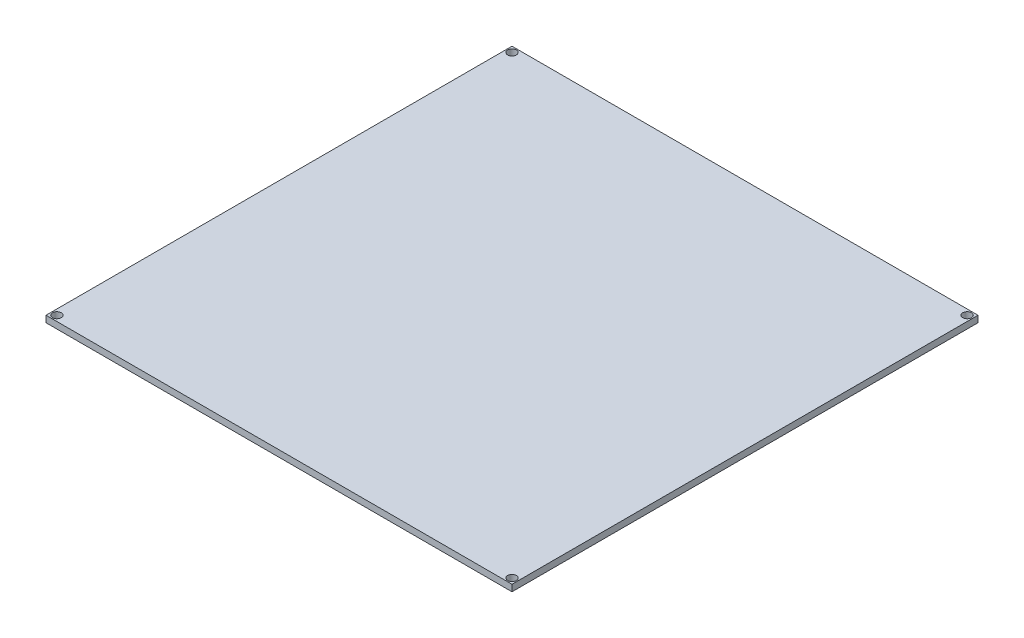
ISO-10303-21;
HEADER;
FILE_DESCRIPTION(('STEP AP214'),'2;1');
FILE_NAME('part.step','',(''),(''),'','','');
FILE_SCHEMA(('AUTOMOTIVE_DESIGN { 1 0 10303 214 1 1 1 1 }'));
ENDSEC;
DATA;
#1=APPLICATION_CONTEXT('core data for automotive mechanical design processes');
#2=APPLICATION_PROTOCOL_DEFINITION('international standard','automotive_design',2000,#1);
#3=PRODUCT_CONTEXT('',#1,'mechanical');
#4=PRODUCT('Part','Part','',(#3));
#5=PRODUCT_RELATED_PRODUCT_CATEGORY('part','',(#4));
#6=PRODUCT_DEFINITION_FORMATION('','',#4);
#7=PRODUCT_DEFINITION_CONTEXT('part definition',#1,'design');
#8=PRODUCT_DEFINITION('design','',#6,#7);
#9=PRODUCT_DEFINITION_SHAPE('','',#8);
#10=(LENGTH_UNIT() NAMED_UNIT(*) SI_UNIT(.MILLI.,.METRE.));
#11=(NAMED_UNIT(*) PLANE_ANGLE_UNIT() SI_UNIT($,.RADIAN.));
#12=(NAMED_UNIT(*) SI_UNIT($,.STERADIAN.) SOLID_ANGLE_UNIT());
#13=UNCERTAINTY_MEASURE_WITH_UNIT(LENGTH_MEASURE(1.E-05),#10,'distance_accuracy_value','');
#14=(GEOMETRIC_REPRESENTATION_CONTEXT(3) GLOBAL_UNCERTAINTY_ASSIGNED_CONTEXT((#13)) GLOBAL_UNIT_ASSIGNED_CONTEXT((#10,
#11,#12)) REPRESENTATION_CONTEXT('',''));
#15=CARTESIAN_POINT('',(0.,0.,0.));
#16=DIRECTION('',(0.,0.,1.));
#17=DIRECTION('',(1.,0.,0.));
#18=AXIS2_PLACEMENT_3D('',#15,#16,#17);
#19=CARTESIAN_POINT('',(0.,3.,0.));
#20=DIRECTION('',(0.,-1.,0.));
#21=DIRECTION('',(0.,0.,-1.));
#22=AXIS2_PLACEMENT_3D('',#19,#20,#21);
#23=PLANE('',#22);
#24=DIRECTION('',(0.,0.,-1.));
#25=VECTOR('',#24,1.);
#26=CARTESIAN_POINT('',(107.,3.,107.));
#27=LINE('',#26,#25);
#28=CARTESIAN_POINT('',(107.,3.,107.));
#29=VERTEX_POINT('',#28);
#30=CARTESIAN_POINT('',(107.,3.,-107.));
#31=VERTEX_POINT('',#30);
#32=EDGE_CURVE('E89',#29,#31,#27,.T.);
#33=ORIENTED_EDGE('',*,*,#32,.T.);
#34=DIRECTION('',(-1.,0.,0.));
#35=VECTOR('',#34,1.);
#36=CARTESIAN_POINT('',(-107.,3.,-107.));
#37=LINE('',#36,#35);
#38=CARTESIAN_POINT('',(-107.,3.,-107.));
#39=VERTEX_POINT('',#38);
#40=EDGE_CURVE('E84',#31,#39,#37,.T.);
#41=ORIENTED_EDGE('',*,*,#40,.T.);
#42=DIRECTION('',(0.,0.,1.));
#43=VECTOR('',#42,1.);
#44=CARTESIAN_POINT('',(-107.,3.,107.));
#45=LINE('',#44,#43);
#46=CARTESIAN_POINT('',(-107.,3.,107.));
#47=VERTEX_POINT('',#46);
#48=EDGE_CURVE('E87',#39,#47,#45,.T.);
#49=ORIENTED_EDGE('',*,*,#48,.T.);
#50=DIRECTION('',(1.,0.,0.));
#51=VECTOR('',#50,1.);
#52=CARTESIAN_POINT('',(-107.,3.,107.));
#53=LINE('',#52,#51);
#54=EDGE_CURVE('E54',#47,#29,#53,.T.);
#55=ORIENTED_EDGE('',*,*,#54,.T.);
#56=EDGE_LOOP('',(#33,#41,#49,#55));
#57=FACE_BOUND('',#56,.T.);
#58=CARTESIAN_POINT('',(-104.5,3.,-104.5));
#59=DIRECTION('',(0.,1.,0.));
#60=DIRECTION('',(0.,0.,1.));
#61=AXIS2_PLACEMENT_3D('',#58,#59,#60);
#62=CIRCLE('',#61,2.);
#63=CARTESIAN_POINT('',(-104.5,3.,-102.5));
#64=VERTEX_POINT('',#63);
#65=EDGE_CURVE('E104',#64,#64,#62,.T.);
#66=ORIENTED_EDGE('',*,*,#65,.F.);
#67=EDGE_LOOP('',(#66));
#68=FACE_BOUND('',#67,.T.);
#69=CARTESIAN_POINT('',(104.5,3.,-104.5));
#70=DIRECTION('',(0.,1.,0.));
#71=DIRECTION('',(0.,0.,1.));
#72=AXIS2_PLACEMENT_3D('',#69,#70,#71);
#73=CIRCLE('',#72,2.);
#74=CARTESIAN_POINT('',(104.5,3.,-102.5));
#75=VERTEX_POINT('',#74);
#76=EDGE_CURVE('E119',#75,#75,#73,.T.);
#77=ORIENTED_EDGE('',*,*,#76,.F.);
#78=EDGE_LOOP('',(#77));
#79=FACE_BOUND('',#78,.T.);
#80=CARTESIAN_POINT('',(104.5,3.,104.5));
#81=DIRECTION('',(0.,1.,0.));
#82=DIRECTION('',(0.,0.,1.));
#83=AXIS2_PLACEMENT_3D('',#80,#81,#82);
#84=CIRCLE('',#83,2.);
#85=CARTESIAN_POINT('',(104.5,3.,106.5));
#86=VERTEX_POINT('',#85);
#87=EDGE_CURVE('E125',#86,#86,#84,.T.);
#88=ORIENTED_EDGE('',*,*,#87,.F.);
#89=EDGE_LOOP('',(#88));
#90=FACE_BOUND('',#89,.T.);
#91=CARTESIAN_POINT('',(-104.5,3.,104.5));
#92=DIRECTION('',(0.,1.,0.));
#93=DIRECTION('',(0.,0.,1.));
#94=AXIS2_PLACEMENT_3D('',#91,#92,#93);
#95=CIRCLE('',#94,2.);
#96=CARTESIAN_POINT('',(-104.5,3.,106.5));
#97=VERTEX_POINT('',#96);
#98=EDGE_CURVE('E131',#97,#97,#95,.T.);
#99=ORIENTED_EDGE('',*,*,#98,.F.);
#100=EDGE_LOOP('',(#99));
#101=FACE_BOUND('',#100,.T.);
#102=ADVANCED_FACE('F37',(#57,#68,#79,#90,#101),#23,.F.);
#103=CARTESIAN_POINT('',(0.,0.,0.));
#104=DIRECTION('',(0.,-1.,0.));
#105=DIRECTION('',(0.,0.,-1.));
#106=AXIS2_PLACEMENT_3D('',#103,#104,#105);
#107=PLANE('',#106);
#108=CARTESIAN_POINT('',(104.5,0.,104.5));
#109=DIRECTION('',(0.,1.,0.));
#110=DIRECTION('',(0.,0.,1.));
#111=AXIS2_PLACEMENT_3D('',#108,#109,#110);
#112=CIRCLE('',#111,2.);
#113=CARTESIAN_POINT('',(104.5,0.,106.5));
#114=VERTEX_POINT('',#113);
#115=EDGE_CURVE('E128',#114,#114,#112,.T.);
#116=ORIENTED_EDGE('',*,*,#115,.T.);
#117=EDGE_LOOP('',(#116));
#118=FACE_BOUND('',#117,.T.);
#119=CARTESIAN_POINT('',(-104.5,0.,-104.5));
#120=DIRECTION('',(0.,1.,0.));
#121=DIRECTION('',(0.,0.,1.));
#122=AXIS2_PLACEMENT_3D('',#119,#120,#121);
#123=CIRCLE('',#122,2.);
#124=CARTESIAN_POINT('',(-104.5,0.,-102.5));
#125=VERTEX_POINT('',#124);
#126=EDGE_CURVE('E116',#125,#125,#123,.T.);
#127=ORIENTED_EDGE('',*,*,#126,.T.);
#128=EDGE_LOOP('',(#127));
#129=FACE_BOUND('',#128,.T.);
#130=DIRECTION('',(0.,0.,-1.));
#131=VECTOR('',#130,1.);
#132=CARTESIAN_POINT('',(107.,0.,107.));
#133=LINE('',#132,#131);
#134=CARTESIAN_POINT('',(107.,0.,107.));
#135=VERTEX_POINT('',#134);
#136=CARTESIAN_POINT('',(107.,0.,-107.));
#137=VERTEX_POINT('',#136);
#138=EDGE_CURVE('E101',#135,#137,#133,.T.);
#139=ORIENTED_EDGE('',*,*,#138,.F.);
#140=DIRECTION('',(1.,0.,0.));
#141=VECTOR('',#140,1.);
#142=CARTESIAN_POINT('',(-107.,0.,107.));
#143=LINE('',#142,#141);
#144=CARTESIAN_POINT('',(-107.,0.,107.));
#145=VERTEX_POINT('',#144);
#146=EDGE_CURVE('E77',#145,#135,#143,.T.);
#147=ORIENTED_EDGE('',*,*,#146,.F.);
#148=DIRECTION('',(0.,0.,1.));
#149=VECTOR('',#148,1.);
#150=CARTESIAN_POINT('',(-107.,0.,107.));
#151=LINE('',#150,#149);
#152=CARTESIAN_POINT('',(-107.,0.,-107.));
#153=VERTEX_POINT('',#152);
#154=EDGE_CURVE('E71',#153,#145,#151,.T.);
#155=ORIENTED_EDGE('',*,*,#154,.F.);
#156=DIRECTION('',(-1.,0.,0.));
#157=VECTOR('',#156,1.);
#158=CARTESIAN_POINT('',(-107.,0.,-107.));
#159=LINE('',#158,#157);
#160=EDGE_CURVE('E93',#137,#153,#159,.T.);
#161=ORIENTED_EDGE('',*,*,#160,.F.);
#162=EDGE_LOOP('',(#139,#147,#155,#161));
#163=FACE_BOUND('',#162,.T.);
#164=CARTESIAN_POINT('',(104.5,0.,-104.5));
#165=DIRECTION('',(0.,1.,0.));
#166=DIRECTION('',(0.,0.,1.));
#167=AXIS2_PLACEMENT_3D('',#164,#165,#166);
#168=CIRCLE('',#167,2.);
#169=CARTESIAN_POINT('',(104.5,0.,-102.5));
#170=VERTEX_POINT('',#169);
#171=EDGE_CURVE('E122',#170,#170,#168,.T.);
#172=ORIENTED_EDGE('',*,*,#171,.T.);
#173=EDGE_LOOP('',(#172));
#174=FACE_BOUND('',#173,.T.);
#175=CARTESIAN_POINT('',(-104.5,0.,104.5));
#176=DIRECTION('',(0.,1.,0.));
#177=DIRECTION('',(0.,0.,1.));
#178=AXIS2_PLACEMENT_3D('',#175,#176,#177);
#179=CIRCLE('',#178,2.);
#180=CARTESIAN_POINT('',(-104.5,0.,106.5));
#181=VERTEX_POINT('',#180);
#182=EDGE_CURVE('E134',#181,#181,#179,.T.);
#183=ORIENTED_EDGE('',*,*,#182,.T.);
#184=EDGE_LOOP('',(#183));
#185=FACE_BOUND('',#184,.T.);
#186=ADVANCED_FACE('F112',(#118,#129,#163,#174,#185),#107,.T.);
#187=CARTESIAN_POINT('',(107.,3.,107.));
#188=DIRECTION('',(-1.,0.,0.));
#189=DIRECTION('',(0.,0.,1.));
#190=AXIS2_PLACEMENT_3D('',#187,#188,#189);
#191=PLANE('',#190);
#192=ORIENTED_EDGE('',*,*,#138,.T.);
#193=DIRECTION('',(0.,-1.,0.));
#194=VECTOR('',#193,1.);
#195=CARTESIAN_POINT('',(107.,3.,-107.));
#196=LINE('',#195,#194);
#197=EDGE_CURVE('E11',#31,#137,#196,.T.);
#198=ORIENTED_EDGE('',*,*,#197,.F.);
#199=ORIENTED_EDGE('',*,*,#32,.F.);
#200=DIRECTION('',(0.,-1.,0.));
#201=VECTOR('',#200,1.);
#202=CARTESIAN_POINT('',(107.,3.,107.));
#203=LINE('',#202,#201);
#204=EDGE_CURVE('E97',#29,#135,#203,.T.);
#205=ORIENTED_EDGE('',*,*,#204,.T.);
#206=EDGE_LOOP('',(#192,#198,#199,#205));
#207=FACE_BOUND('',#206,.T.);
#208=ADVANCED_FACE('F39',(#207),#191,.F.);
#209=CARTESIAN_POINT('',(-107.,3.,-107.));
#210=DIRECTION('',(0.,0.,1.));
#211=DIRECTION('',(1.,0.,0.));
#212=AXIS2_PLACEMENT_3D('',#209,#210,#211);
#213=PLANE('',#212);
#214=ORIENTED_EDGE('',*,*,#160,.T.);
#215=DIRECTION('',(0.,-1.,0.));
#216=VECTOR('',#215,1.);
#217=CARTESIAN_POINT('',(-107.,3.,-107.));
#218=LINE('',#217,#216);
#219=EDGE_CURVE('E46',#39,#153,#218,.T.);
#220=ORIENTED_EDGE('',*,*,#219,.F.);
#221=ORIENTED_EDGE('',*,*,#40,.F.);
#222=ORIENTED_EDGE('',*,*,#197,.T.);
#223=EDGE_LOOP('',(#214,#220,#221,#222));
#224=FACE_BOUND('',#223,.T.);
#225=ADVANCED_FACE('F92',(#224),#213,.F.);
#226=CARTESIAN_POINT('',(-107.,3.,107.));
#227=DIRECTION('',(1.,0.,0.));
#228=DIRECTION('',(0.,0.,-1.));
#229=AXIS2_PLACEMENT_3D('',#226,#227,#228);
#230=PLANE('',#229);
#231=ORIENTED_EDGE('',*,*,#154,.T.);
#232=DIRECTION('',(0.,-1.,0.));
#233=VECTOR('',#232,1.);
#234=CARTESIAN_POINT('',(-107.,3.,107.));
#235=LINE('',#234,#233);
#236=EDGE_CURVE('E94',#47,#145,#235,.T.);
#237=ORIENTED_EDGE('',*,*,#236,.F.);
#238=ORIENTED_EDGE('',*,*,#48,.F.);
#239=ORIENTED_EDGE('',*,*,#219,.T.);
#240=EDGE_LOOP('',(#231,#237,#238,#239));
#241=FACE_BOUND('',#240,.T.);
#242=ADVANCED_FACE('F95',(#241),#230,.F.);
#243=CARTESIAN_POINT('',(-107.,3.,107.));
#244=DIRECTION('',(0.,0.,-1.));
#245=DIRECTION('',(-1.,0.,0.));
#246=AXIS2_PLACEMENT_3D('',#243,#244,#245);
#247=PLANE('',#246);
#248=ORIENTED_EDGE('',*,*,#146,.T.);
#249=ORIENTED_EDGE('',*,*,#204,.F.);
#250=ORIENTED_EDGE('',*,*,#54,.F.);
#251=ORIENTED_EDGE('',*,*,#236,.T.);
#252=EDGE_LOOP('',(#248,#249,#250,#251));
#253=FACE_BOUND('',#252,.T.);
#254=ADVANCED_FACE('F109',(#253),#247,.F.);
#255=CARTESIAN_POINT('',(-104.5,3.,-104.5));
#256=DIRECTION('',(0.,-1.,0.));
#257=DIRECTION('',(0.,0.,-1.));
#258=AXIS2_PLACEMENT_3D('',#255,#256,#257);
#259=CYLINDRICAL_SURFACE('',#258,2.);
#260=ORIENTED_EDGE('',*,*,#65,.T.);
#261=EDGE_LOOP('',(#260));
#262=FACE_BOUND('',#261,.T.);
#263=ORIENTED_EDGE('',*,*,#126,.F.);
#264=EDGE_LOOP('',(#263));
#265=FACE_BOUND('',#264,.T.);
#266=ADVANCED_FACE('F151',(#262,#265),#259,.F.);
#267=CARTESIAN_POINT('',(104.5,3.,-104.5));
#268=DIRECTION('',(0.,-1.,0.));
#269=DIRECTION('',(0.,0.,-1.));
#270=AXIS2_PLACEMENT_3D('',#267,#268,#269);
#271=CYLINDRICAL_SURFACE('',#270,2.);
#272=ORIENTED_EDGE('',*,*,#76,.T.);
#273=EDGE_LOOP('',(#272));
#274=FACE_BOUND('',#273,.T.);
#275=ORIENTED_EDGE('',*,*,#171,.F.);
#276=EDGE_LOOP('',(#275));
#277=FACE_BOUND('',#276,.T.);
#278=ADVANCED_FACE('F205',(#274,#277),#271,.F.);
#279=CARTESIAN_POINT('',(104.5,3.,104.5));
#280=DIRECTION('',(0.,-1.,0.));
#281=DIRECTION('',(0.,0.,-1.));
#282=AXIS2_PLACEMENT_3D('',#279,#280,#281);
#283=CYLINDRICAL_SURFACE('',#282,2.);
#284=ORIENTED_EDGE('',*,*,#87,.T.);
#285=EDGE_LOOP('',(#284));
#286=FACE_BOUND('',#285,.T.);
#287=ORIENTED_EDGE('',*,*,#115,.F.);
#288=EDGE_LOOP('',(#287));
#289=FACE_BOUND('',#288,.T.);
#290=ADVANCED_FACE('F214',(#286,#289),#283,.F.);
#291=CARTESIAN_POINT('',(-104.5,3.,104.5));
#292=DIRECTION('',(0.,-1.,0.));
#293=DIRECTION('',(0.,0.,-1.));
#294=AXIS2_PLACEMENT_3D('',#291,#292,#293);
#295=CYLINDRICAL_SURFACE('',#294,2.);
#296=ORIENTED_EDGE('',*,*,#98,.T.);
#297=EDGE_LOOP('',(#296));
#298=FACE_BOUND('',#297,.T.);
#299=ORIENTED_EDGE('',*,*,#182,.F.);
#300=EDGE_LOOP('',(#299));
#301=FACE_BOUND('',#300,.T.);
#302=ADVANCED_FACE('F140',(#298,#301),#295,.F.);
#303=CLOSED_SHELL('',(#102,#186,#208,#225,#242,#254,#266,#278,#290,#302));
#304=MANIFOLD_SOLID_BREP('B2',#303);
#305=ADVANCED_BREP_SHAPE_REPRESENTATION('',(#18,#304),#14);
#306=SHAPE_DEFINITION_REPRESENTATION(#9,#305);
ENDSEC;
END-ISO-10303-21;
